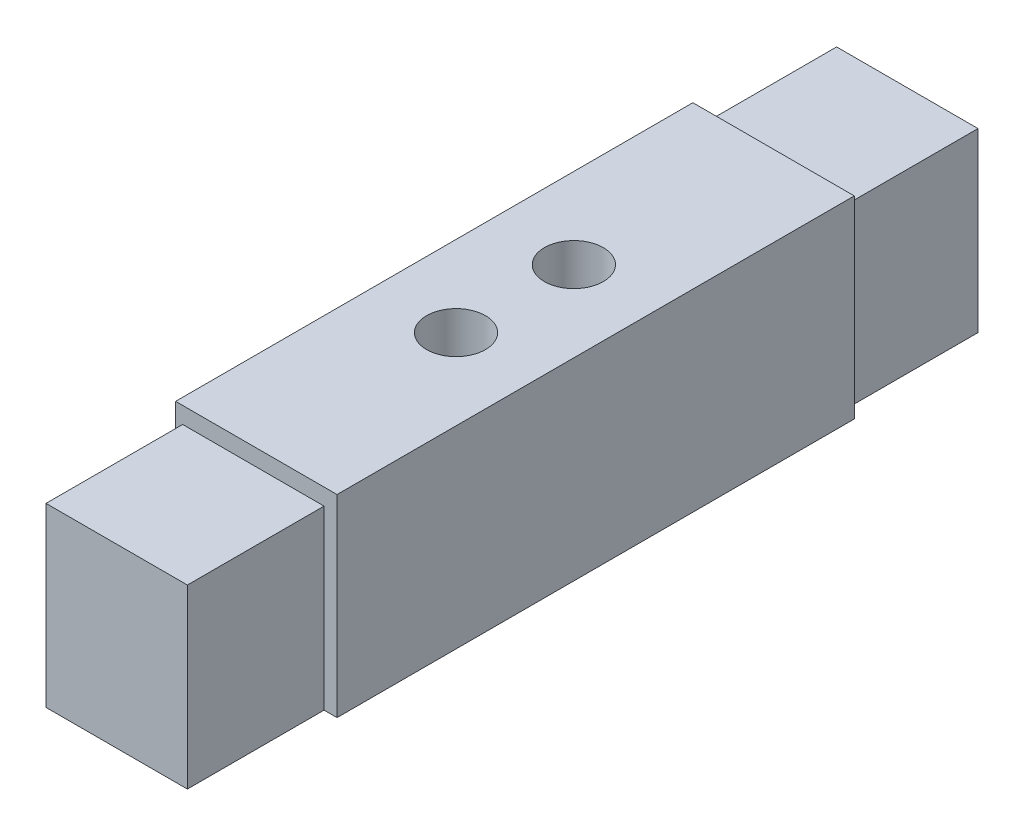
ISO-10303-21;
HEADER;
FILE_DESCRIPTION(('STEP AP214'),'2;1');
FILE_NAME('part.step','',(''),(''),'','','');
FILE_SCHEMA(('AUTOMOTIVE_DESIGN { 1 0 10303 214 1 1 1 1 }'));
ENDSEC;
DATA;
#1=APPLICATION_CONTEXT('core data for automotive mechanical design processes');
#2=APPLICATION_PROTOCOL_DEFINITION('international standard','automotive_design',2000,#1);
#3=PRODUCT_CONTEXT('',#1,'mechanical');
#4=PRODUCT('Part','Part','',(#3));
#5=PRODUCT_RELATED_PRODUCT_CATEGORY('part','',(#4));
#6=PRODUCT_DEFINITION_FORMATION('','',#4);
#7=PRODUCT_DEFINITION_CONTEXT('part definition',#1,'design');
#8=PRODUCT_DEFINITION('design','',#6,#7);
#9=PRODUCT_DEFINITION_SHAPE('','',#8);
#10=(LENGTH_UNIT() NAMED_UNIT(*) SI_UNIT(.MILLI.,.METRE.));
#11=(NAMED_UNIT(*) PLANE_ANGLE_UNIT() SI_UNIT($,.RADIAN.));
#12=(NAMED_UNIT(*) SI_UNIT($,.STERADIAN.) SOLID_ANGLE_UNIT());
#13=UNCERTAINTY_MEASURE_WITH_UNIT(LENGTH_MEASURE(1.E-05),#10,'distance_accuracy_value','');
#14=(GEOMETRIC_REPRESENTATION_CONTEXT(3) GLOBAL_UNCERTAINTY_ASSIGNED_CONTEXT((#13)) GLOBAL_UNIT_ASSIGNED_CONTEXT((#10,
#11,#12)) REPRESENTATION_CONTEXT('',''));
#15=CARTESIAN_POINT('',(0.,0.,0.));
#16=DIRECTION('',(0.,0.,1.));
#17=DIRECTION('',(1.,0.,0.));
#18=AXIS2_PLACEMENT_3D('',#15,#16,#17);
#19=CARTESIAN_POINT('',(0.,0.,0.));
#20=DIRECTION('',(0.,0.,-1.));
#21=DIRECTION('',(-1.,0.,0.));
#22=AXIS2_PLACEMENT_3D('',#19,#20,#21);
#23=PLANE('',#22);
#24=DIRECTION('',(1.,0.,0.));
#25=VECTOR('',#24,1.);
#26=CARTESIAN_POINT('',(0.,0.,0.));
#27=LINE('',#26,#25);
#28=CARTESIAN_POINT('',(32.004,0.,0.));
#29=VERTEX_POINT('',#28);
#30=CARTESIAN_POINT('',(34.798,0.,0.));
#31=VERTEX_POINT('',#30);
#32=EDGE_CURVE('E58',#29,#31,#27,.T.);
#33=ORIENTED_EDGE('',*,*,#32,.F.);
#34=DIRECTION('',(0.,1.,0.));
#35=VECTOR('',#34,1.);
#36=CARTESIAN_POINT('',(32.004,0.,0.));
#37=LINE('',#36,#35);
#38=CARTESIAN_POINT('',(32.004,38.1,0.));
#39=VERTEX_POINT('',#38);
#40=EDGE_CURVE('E53',#29,#39,#37,.T.);
#41=ORIENTED_EDGE('',*,*,#40,.T.);
#42=DIRECTION('',(1.,0.,0.));
#43=VECTOR('',#42,1.);
#44=CARTESIAN_POINT('',(1.52400000000001,38.1,0.));
#45=LINE('',#44,#43);
#46=CARTESIAN_POINT('',(1.52400000000001,38.1,0.));
#47=VERTEX_POINT('',#46);
#48=EDGE_CURVE('E151',#47,#39,#45,.T.);
#49=ORIENTED_EDGE('',*,*,#48,.F.);
#50=DIRECTION('',(0.,1.,0.));
#51=VECTOR('',#50,1.);
#52=CARTESIAN_POINT('',(1.52400000000001,0.,0.));
#53=LINE('',#52,#51);
#54=CARTESIAN_POINT('',(1.52400000000001,0.,0.));
#55=VERTEX_POINT('',#54);
#56=EDGE_CURVE('E160',#55,#47,#53,.T.);
#57=ORIENTED_EDGE('',*,*,#56,.F.);
#58=CARTESIAN_POINT('',(0.,0.,0.));
#59=VERTEX_POINT('',#58);
#60=EDGE_CURVE('E133',#59,#55,#27,.T.);
#61=ORIENTED_EDGE('',*,*,#60,.F.);
#62=DIRECTION('',(0.,1.,0.));
#63=VECTOR('',#62,1.);
#64=CARTESIAN_POINT('',(0.,0.,0.));
#65=LINE('',#64,#63);
#66=CARTESIAN_POINT('',(0.,41.656,0.));
#67=VERTEX_POINT('',#66);
#68=EDGE_CURVE('E198',#59,#67,#65,.T.);
#69=ORIENTED_EDGE('',*,*,#68,.T.);
#70=DIRECTION('',(1.,0.,0.));
#71=VECTOR('',#70,1.);
#72=CARTESIAN_POINT('',(0.,41.656,0.));
#73=LINE('',#72,#71);
#74=CARTESIAN_POINT('',(34.798,41.656,0.));
#75=VERTEX_POINT('',#74);
#76=EDGE_CURVE('E212',#67,#75,#73,.T.);
#77=ORIENTED_EDGE('',*,*,#76,.T.);
#78=DIRECTION('',(0.,1.,0.));
#79=VECTOR('',#78,1.);
#80=CARTESIAN_POINT('',(34.798,0.,0.));
#81=LINE('',#80,#79);
#82=EDGE_CURVE('E215',#31,#75,#81,.T.);
#83=ORIENTED_EDGE('',*,*,#82,.F.);
#84=EDGE_LOOP('',(#33,#41,#49,#57,#61,#69,#77,#83));
#85=FACE_BOUND('',#84,.T.);
#86=ADVANCED_FACE('F36',(#85),#23,.T.);
#87=CARTESIAN_POINT('',(0.,0.,111.506));
#88=DIRECTION('',(-1.,0.,0.));
#89=DIRECTION('',(0.,0.,1.));
#90=AXIS2_PLACEMENT_3D('',#87,#88,#89);
#91=PLANE('',#90);
#92=ORIENTED_EDGE('',*,*,#68,.F.);
#93=DIRECTION('',(0.,0.,-1.));
#94=VECTOR('',#93,1.);
#95=CARTESIAN_POINT('',(0.,0.,111.506));
#96=LINE('',#95,#94);
#97=CARTESIAN_POINT('',(0.,0.,111.506));
#98=VERTEX_POINT('',#97);
#99=EDGE_CURVE('E11',#98,#59,#96,.T.);
#100=ORIENTED_EDGE('',*,*,#99,.F.);
#101=DIRECTION('',(0.,1.,0.));
#102=VECTOR('',#101,1.);
#103=CARTESIAN_POINT('',(0.,0.,111.506));
#104=LINE('',#103,#102);
#105=CARTESIAN_POINT('',(0.,41.656,111.506));
#106=VERTEX_POINT('',#105);
#107=EDGE_CURVE('E199',#98,#106,#104,.T.);
#108=ORIENTED_EDGE('',*,*,#107,.T.);
#109=DIRECTION('',(0.,0.,-1.));
#110=VECTOR('',#109,1.);
#111=CARTESIAN_POINT('',(0.,41.656,111.506));
#112=LINE('',#111,#110);
#113=EDGE_CURVE('E40',#106,#67,#112,.T.);
#114=ORIENTED_EDGE('',*,*,#113,.T.);
#115=EDGE_LOOP('',(#92,#100,#108,#114));
#116=FACE_BOUND('',#115,.T.);
#117=ADVANCED_FACE('F38',(#116),#91,.T.);
#118=CARTESIAN_POINT('',(0.,0.,111.506));
#119=DIRECTION('',(0.,1.,0.));
#120=DIRECTION('',(0.,0.,1.));
#121=AXIS2_PLACEMENT_3D('',#118,#119,#120);
#122=PLANE('',#121);
#123=CARTESIAN_POINT('',(16.764,0.,55.753));
#124=DIRECTION('',(0.,-1.,0.));
#125=DIRECTION('',(0.,0.,-1.));
#126=AXIS2_PLACEMENT_3D('',#123,#124,#125);
#127=CIRCLE('',#126,6.35);
#128=CARTESIAN_POINT('',(16.764,0.,49.403));
#129=VERTEX_POINT('',#128);
#130=EDGE_CURVE('E154',#129,#129,#127,.T.);
#131=ORIENTED_EDGE('',*,*,#130,.F.);
#132=EDGE_LOOP('',(#131));
#133=FACE_BOUND('',#132,.T.);
#134=ORIENTED_EDGE('',*,*,#60,.T.);
#135=DIRECTION('',(0.,0.,1.));
#136=VECTOR('',#135,1.);
#137=CARTESIAN_POINT('',(1.52400000000001,0.,-29.464));
#138=LINE('',#137,#136);
#139=CARTESIAN_POINT('',(1.52400000000001,0.,-29.464));
#140=VERTEX_POINT('',#139);
#141=EDGE_CURVE('E126',#140,#55,#138,.T.);
#142=ORIENTED_EDGE('',*,*,#141,.F.);
#143=DIRECTION('',(1.,0.,0.));
#144=VECTOR('',#143,1.);
#145=CARTESIAN_POINT('',(1.52400000000001,0.,-29.464));
#146=LINE('',#145,#144);
#147=CARTESIAN_POINT('',(32.004,0.,-29.464));
#148=VERTEX_POINT('',#147);
#149=EDGE_CURVE('E130',#140,#148,#146,.T.);
#150=ORIENTED_EDGE('',*,*,#149,.T.);
#151=DIRECTION('',(0.,0.,1.));
#152=VECTOR('',#151,1.);
#153=CARTESIAN_POINT('',(32.004,0.,-29.464));
#154=LINE('',#153,#152);
#155=EDGE_CURVE('E159',#148,#29,#154,.T.);
#156=ORIENTED_EDGE('',*,*,#155,.T.);
#157=ORIENTED_EDGE('',*,*,#32,.T.);
#158=DIRECTION('',(0.,0.,-1.));
#159=VECTOR('',#158,1.);
#160=CARTESIAN_POINT('',(34.798,0.,111.506));
#161=LINE('',#160,#159);
#162=CARTESIAN_POINT('',(34.798,0.,111.506));
#163=VERTEX_POINT('',#162);
#164=EDGE_CURVE('E45',#163,#31,#161,.T.);
#165=ORIENTED_EDGE('',*,*,#164,.F.);
#166=DIRECTION('',(1.,0.,0.));
#167=VECTOR('',#166,1.);
#168=CARTESIAN_POINT('',(0.,0.,111.506));
#169=LINE('',#168,#167);
#170=CARTESIAN_POINT('',(32.004,0.,111.506));
#171=VERTEX_POINT('',#170);
#172=EDGE_CURVE('E207',#171,#163,#169,.T.);
#173=ORIENTED_EDGE('',*,*,#172,.F.);
#174=DIRECTION('',(0.,0.,-1.));
#175=VECTOR('',#174,1.);
#176=CARTESIAN_POINT('',(32.004,0.,140.97));
#177=LINE('',#176,#175);
#178=CARTESIAN_POINT('',(32.004,0.,140.97));
#179=VERTEX_POINT('',#178);
#180=EDGE_CURVE('E195',#179,#171,#177,.T.);
#181=ORIENTED_EDGE('',*,*,#180,.F.);
#182=DIRECTION('',(1.,0.,0.));
#183=VECTOR('',#182,1.);
#184=CARTESIAN_POINT('',(1.52400000000001,0.,140.97));
#185=LINE('',#184,#183);
#186=CARTESIAN_POINT('',(1.52400000000001,0.,140.97));
#187=VERTEX_POINT('',#186);
#188=EDGE_CURVE('E169',#187,#179,#185,.T.);
#189=ORIENTED_EDGE('',*,*,#188,.F.);
#190=DIRECTION('',(0.,0.,-1.));
#191=VECTOR('',#190,1.);
#192=CARTESIAN_POINT('',(1.52400000000001,0.,140.97));
#193=LINE('',#192,#191);
#194=CARTESIAN_POINT('',(1.52400000000001,0.,111.506));
#195=VERTEX_POINT('',#194);
#196=EDGE_CURVE('E181',#187,#195,#193,.T.);
#197=ORIENTED_EDGE('',*,*,#196,.T.);
#198=EDGE_CURVE('E208',#98,#195,#169,.T.);
#199=ORIENTED_EDGE('',*,*,#198,.F.);
#200=ORIENTED_EDGE('',*,*,#99,.T.);
#201=EDGE_LOOP('',(#134,#142,#150,#156,#157,#165,#173,#181,#189,#197,#199,#200));
#202=FACE_BOUND('',#201,.T.);
#203=ADVANCED_FACE('F128',(#133,#202),#122,.F.);
#204=CARTESIAN_POINT('',(34.798,0.,111.506));
#205=DIRECTION('',(-1.,0.,0.));
#206=DIRECTION('',(0.,0.,1.));
#207=AXIS2_PLACEMENT_3D('',#204,#205,#206);
#208=PLANE('',#207);
#209=ORIENTED_EDGE('',*,*,#82,.T.);
#210=DIRECTION('',(0.,0.,-1.));
#211=VECTOR('',#210,1.);
#212=CARTESIAN_POINT('',(34.798,41.656,111.506));
#213=LINE('',#212,#211);
#214=CARTESIAN_POINT('',(34.798,41.656,111.506));
#215=VERTEX_POINT('',#214);
#216=EDGE_CURVE('E220',#215,#75,#213,.T.);
#217=ORIENTED_EDGE('',*,*,#216,.F.);
#218=DIRECTION('',(0.,1.,0.));
#219=VECTOR('',#218,1.);
#220=CARTESIAN_POINT('',(34.798,0.,111.506));
#221=LINE('',#220,#219);
#222=EDGE_CURVE('E205',#163,#215,#221,.T.);
#223=ORIENTED_EDGE('',*,*,#222,.F.);
#224=ORIENTED_EDGE('',*,*,#164,.T.);
#225=EDGE_LOOP('',(#209,#217,#223,#224));
#226=FACE_BOUND('',#225,.T.);
#227=ADVANCED_FACE('F238',(#226),#208,.F.);
#228=CARTESIAN_POINT('',(0.,41.656,111.506));
#229=DIRECTION('',(0.,1.,0.));
#230=DIRECTION('',(0.,0.,1.));
#231=AXIS2_PLACEMENT_3D('',#228,#229,#230);
#232=PLANE('',#231);
#233=CARTESIAN_POINT('',(17.399,41.656,68.453));
#234=DIRECTION('',(0.,1.,0.));
#235=DIRECTION('',(0.,0.,1.));
#236=AXIS2_PLACEMENT_3D('',#233,#234,#235);
#237=CIRCLE('',#236,6.35);
#238=CARTESIAN_POINT('',(17.399,41.656,74.803));
#239=VERTEX_POINT('',#238);
#240=EDGE_CURVE('E284',#239,#239,#237,.T.);
#241=ORIENTED_EDGE('',*,*,#240,.F.);
#242=EDGE_LOOP('',(#241));
#243=FACE_BOUND('',#242,.T.);
#244=CARTESIAN_POINT('',(17.399,41.656,43.053));
#245=DIRECTION('',(0.,1.,0.));
#246=DIRECTION('',(0.,0.,1.));
#247=AXIS2_PLACEMENT_3D('',#244,#245,#246);
#248=CIRCLE('',#247,6.35);
#249=CARTESIAN_POINT('',(17.399,41.656,49.403));
#250=VERTEX_POINT('',#249);
#251=EDGE_CURVE('E287',#250,#250,#248,.T.);
#252=ORIENTED_EDGE('',*,*,#251,.F.);
#253=EDGE_LOOP('',(#252));
#254=FACE_BOUND('',#253,.T.);
#255=ORIENTED_EDGE('',*,*,#76,.F.);
#256=ORIENTED_EDGE('',*,*,#113,.F.);
#257=DIRECTION('',(1.,0.,0.));
#258=VECTOR('',#257,1.);
#259=CARTESIAN_POINT('',(0.,41.656,111.506));
#260=LINE('',#259,#258);
#261=EDGE_CURVE('E202',#106,#215,#260,.T.);
#262=ORIENTED_EDGE('',*,*,#261,.T.);
#263=ORIENTED_EDGE('',*,*,#216,.T.);
#264=EDGE_LOOP('',(#255,#256,#262,#263));
#265=FACE_BOUND('',#264,.T.);
#266=ADVANCED_FACE('F228',(#243,#254,#265),#232,.T.);
#267=CARTESIAN_POINT('',(0.,0.,111.506));
#268=DIRECTION('',(0.,0.,-1.));
#269=DIRECTION('',(-1.,0.,0.));
#270=AXIS2_PLACEMENT_3D('',#267,#268,#269);
#271=PLANE('',#270);
#272=ORIENTED_EDGE('',*,*,#198,.T.);
#273=DIRECTION('',(0.,1.,0.));
#274=VECTOR('',#273,1.);
#275=CARTESIAN_POINT('',(1.52400000000001,0.,111.506));
#276=LINE('',#275,#274);
#277=CARTESIAN_POINT('',(1.52400000000001,38.1,111.506));
#278=VERTEX_POINT('',#277);
#279=EDGE_CURVE('E173',#195,#278,#276,.T.);
#280=ORIENTED_EDGE('',*,*,#279,.T.);
#281=DIRECTION('',(1.,0.,0.));
#282=VECTOR('',#281,1.);
#283=CARTESIAN_POINT('',(1.52400000000001,38.1,111.506));
#284=LINE('',#283,#282);
#285=CARTESIAN_POINT('',(32.004,38.1,111.506));
#286=VERTEX_POINT('',#285);
#287=EDGE_CURVE('E184',#278,#286,#284,.T.);
#288=ORIENTED_EDGE('',*,*,#287,.T.);
#289=DIRECTION('',(0.,1.,0.));
#290=VECTOR('',#289,1.);
#291=CARTESIAN_POINT('',(32.004,0.,111.506));
#292=LINE('',#291,#290);
#293=EDGE_CURVE('E136',#171,#286,#292,.T.);
#294=ORIENTED_EDGE('',*,*,#293,.F.);
#295=ORIENTED_EDGE('',*,*,#172,.T.);
#296=ORIENTED_EDGE('',*,*,#222,.T.);
#297=ORIENTED_EDGE('',*,*,#261,.F.);
#298=ORIENTED_EDGE('',*,*,#107,.F.);
#299=EDGE_LOOP('',(#272,#280,#288,#294,#295,#296,#297,#298));
#300=FACE_BOUND('',#299,.T.);
#301=ADVANCED_FACE('F240',(#300),#271,.F.);
#302=CARTESIAN_POINT('',(32.004,0.,140.97));
#303=DIRECTION('',(-1.,0.,0.));
#304=DIRECTION('',(0.,0.,1.));
#305=AXIS2_PLACEMENT_3D('',#302,#303,#304);
#306=PLANE('',#305);
#307=ORIENTED_EDGE('',*,*,#293,.T.);
#308=DIRECTION('',(0.,0.,-1.));
#309=VECTOR('',#308,1.);
#310=CARTESIAN_POINT('',(32.004,38.1,140.97));
#311=LINE('',#310,#309);
#312=CARTESIAN_POINT('',(32.004,38.1,140.97));
#313=VERTEX_POINT('',#312);
#314=EDGE_CURVE('E192',#313,#286,#311,.T.);
#315=ORIENTED_EDGE('',*,*,#314,.F.);
#316=DIRECTION('',(0.,1.,0.));
#317=VECTOR('',#316,1.);
#318=CARTESIAN_POINT('',(32.004,0.,140.97));
#319=LINE('',#318,#317);
#320=EDGE_CURVE('E172',#179,#313,#319,.T.);
#321=ORIENTED_EDGE('',*,*,#320,.F.);
#322=ORIENTED_EDGE('',*,*,#180,.T.);
#323=EDGE_LOOP('',(#307,#315,#321,#322));
#324=FACE_BOUND('',#323,.T.);
#325=ADVANCED_FACE('F244',(#324),#306,.F.);
#326=CARTESIAN_POINT('',(1.52400000000001,38.1,140.97));
#327=DIRECTION('',(0.,1.,0.));
#328=DIRECTION('',(0.,0.,1.));
#329=AXIS2_PLACEMENT_3D('',#326,#327,#328);
#330=PLANE('',#329);
#331=ORIENTED_EDGE('',*,*,#287,.F.);
#332=DIRECTION('',(0.,0.,-1.));
#333=VECTOR('',#332,1.);
#334=CARTESIAN_POINT('',(1.52400000000001,38.1,140.97));
#335=LINE('',#334,#333);
#336=CARTESIAN_POINT('',(1.52400000000001,38.1,140.97));
#337=VERTEX_POINT('',#336);
#338=EDGE_CURVE('E189',#337,#278,#335,.T.);
#339=ORIENTED_EDGE('',*,*,#338,.F.);
#340=DIRECTION('',(1.,0.,0.));
#341=VECTOR('',#340,1.);
#342=CARTESIAN_POINT('',(1.52400000000001,38.1,140.97));
#343=LINE('',#342,#341);
#344=EDGE_CURVE('E175',#337,#313,#343,.T.);
#345=ORIENTED_EDGE('',*,*,#344,.T.);
#346=ORIENTED_EDGE('',*,*,#314,.T.);
#347=EDGE_LOOP('',(#331,#339,#345,#346));
#348=FACE_BOUND('',#347,.T.);
#349=ADVANCED_FACE('F256',(#348),#330,.T.);
#350=CARTESIAN_POINT('',(1.52400000000001,0.,140.97));
#351=DIRECTION('',(-1.,0.,0.));
#352=DIRECTION('',(0.,0.,1.));
#353=AXIS2_PLACEMENT_3D('',#350,#351,#352);
#354=PLANE('',#353);
#355=ORIENTED_EDGE('',*,*,#279,.F.);
#356=ORIENTED_EDGE('',*,*,#196,.F.);
#357=DIRECTION('',(0.,1.,0.));
#358=VECTOR('',#357,1.);
#359=CARTESIAN_POINT('',(1.52400000000001,0.,140.97));
#360=LINE('',#359,#358);
#361=EDGE_CURVE('E178',#187,#337,#360,.T.);
#362=ORIENTED_EDGE('',*,*,#361,.T.);
#363=ORIENTED_EDGE('',*,*,#338,.T.);
#364=EDGE_LOOP('',(#355,#356,#362,#363));
#365=FACE_BOUND('',#364,.T.);
#366=ADVANCED_FACE('F253',(#365),#354,.T.);
#367=CARTESIAN_POINT('',(0.,0.,140.97));
#368=DIRECTION('',(0.,0.,1.));
#369=DIRECTION('',(1.,0.,0.));
#370=AXIS2_PLACEMENT_3D('',#367,#368,#369);
#371=PLANE('',#370);
#372=ORIENTED_EDGE('',*,*,#188,.T.);
#373=ORIENTED_EDGE('',*,*,#320,.T.);
#374=ORIENTED_EDGE('',*,*,#344,.F.);
#375=ORIENTED_EDGE('',*,*,#361,.F.);
#376=EDGE_LOOP('',(#372,#373,#374,#375));
#377=FACE_BOUND('',#376,.T.);
#378=ADVANCED_FACE('F249',(#377),#371,.T.);
#379=CARTESIAN_POINT('',(1.52400000000001,0.,-29.464));
#380=DIRECTION('',(1.,0.,0.));
#381=DIRECTION('',(0.,0.,-1.));
#382=AXIS2_PLACEMENT_3D('',#379,#380,#381);
#383=PLANE('',#382);
#384=ORIENTED_EDGE('',*,*,#56,.T.);
#385=DIRECTION('',(0.,0.,1.));
#386=VECTOR('',#385,1.);
#387=CARTESIAN_POINT('',(1.52400000000001,38.1,-29.464));
#388=LINE('',#387,#386);
#389=CARTESIAN_POINT('',(1.52400000000001,38.1,-29.464));
#390=VERTEX_POINT('',#389);
#391=EDGE_CURVE('E137',#390,#47,#388,.T.);
#392=ORIENTED_EDGE('',*,*,#391,.F.);
#393=DIRECTION('',(0.,1.,0.));
#394=VECTOR('',#393,1.);
#395=CARTESIAN_POINT('',(1.52400000000001,0.,-29.464));
#396=LINE('',#395,#394);
#397=EDGE_CURVE('E140',#140,#390,#396,.T.);
#398=ORIENTED_EDGE('',*,*,#397,.F.);
#399=ORIENTED_EDGE('',*,*,#141,.T.);
#400=EDGE_LOOP('',(#384,#392,#398,#399));
#401=FACE_BOUND('',#400,.T.);
#402=ADVANCED_FACE('F141',(#401),#383,.F.);
#403=CARTESIAN_POINT('',(1.52400000000001,38.1,-29.464));
#404=DIRECTION('',(0.,-1.,0.));
#405=DIRECTION('',(0.,0.,-1.));
#406=AXIS2_PLACEMENT_3D('',#403,#404,#405);
#407=PLANE('',#406);
#408=ORIENTED_EDGE('',*,*,#48,.T.);
#409=DIRECTION('',(0.,0.,1.));
#410=VECTOR('',#409,1.);
#411=CARTESIAN_POINT('',(32.004,38.1,-29.464));
#412=LINE('',#411,#410);
#413=CARTESIAN_POINT('',(32.004,38.1,-29.464));
#414=VERTEX_POINT('',#413);
#415=EDGE_CURVE('E166',#414,#39,#412,.T.);
#416=ORIENTED_EDGE('',*,*,#415,.F.);
#417=DIRECTION('',(1.,0.,0.));
#418=VECTOR('',#417,1.);
#419=CARTESIAN_POINT('',(1.52400000000001,38.1,-29.464));
#420=LINE('',#419,#418);
#421=EDGE_CURVE('E145',#390,#414,#420,.T.);
#422=ORIENTED_EDGE('',*,*,#421,.F.);
#423=ORIENTED_EDGE('',*,*,#391,.T.);
#424=EDGE_LOOP('',(#408,#416,#422,#423));
#425=FACE_BOUND('',#424,.T.);
#426=ADVANCED_FACE('F230',(#425),#407,.F.);
#427=CARTESIAN_POINT('',(32.004,0.,-29.464));
#428=DIRECTION('',(1.,0.,0.));
#429=DIRECTION('',(0.,0.,-1.));
#430=AXIS2_PLACEMENT_3D('',#427,#428,#429);
#431=PLANE('',#430);
#432=ORIENTED_EDGE('',*,*,#40,.F.);
#433=ORIENTED_EDGE('',*,*,#155,.F.);
#434=DIRECTION('',(0.,1.,0.));
#435=VECTOR('',#434,1.);
#436=CARTESIAN_POINT('',(32.004,0.,-29.464));
#437=LINE('',#436,#435);
#438=EDGE_CURVE('E149',#148,#414,#437,.T.);
#439=ORIENTED_EDGE('',*,*,#438,.T.);
#440=ORIENTED_EDGE('',*,*,#415,.T.);
#441=EDGE_LOOP('',(#432,#433,#439,#440));
#442=FACE_BOUND('',#441,.T.);
#443=ADVANCED_FACE('F233',(#442),#431,.T.);
#444=CARTESIAN_POINT('',(0.,0.,-29.464));
#445=DIRECTION('',(0.,0.,-1.));
#446=DIRECTION('',(1.,0.,0.));
#447=AXIS2_PLACEMENT_3D('',#444,#445,#446);
#448=PLANE('',#447);
#449=ORIENTED_EDGE('',*,*,#149,.F.);
#450=ORIENTED_EDGE('',*,*,#397,.T.);
#451=ORIENTED_EDGE('',*,*,#421,.T.);
#452=ORIENTED_EDGE('',*,*,#438,.F.);
#453=EDGE_LOOP('',(#449,#450,#451,#452));
#454=FACE_BOUND('',#453,.T.);
#455=ADVANCED_FACE('F147',(#454),#448,.T.);
#456=CARTESIAN_POINT('',(16.764,12.7,55.753));
#457=DIRECTION('',(0.,-1.,0.));
#458=DIRECTION('',(0.,0.,-1.));
#459=AXIS2_PLACEMENT_3D('',#456,#457,#458);
#460=CYLINDRICAL_SURFACE('',#459,6.35);
#461=CARTESIAN_POINT('',(16.764,12.7,55.753));
#462=DIRECTION('',(0.,-1.,0.));
#463=DIRECTION('',(0.,0.,-1.));
#464=AXIS2_PLACEMENT_3D('',#461,#462,#463);
#465=CIRCLE('',#464,6.35);
#466=CARTESIAN_POINT('',(16.764,12.7,49.403));
#467=VERTEX_POINT('',#466);
#468=EDGE_CURVE('E162',#467,#467,#465,.T.);
#469=ORIENTED_EDGE('',*,*,#468,.F.);
#470=EDGE_LOOP('',(#469));
#471=FACE_BOUND('',#470,.T.);
#472=ORIENTED_EDGE('',*,*,#130,.T.);
#473=EDGE_LOOP('',(#472));
#474=FACE_BOUND('',#473,.T.);
#475=ADVANCED_FACE('F327',(#471,#474),#460,.F.);
#476=CARTESIAN_POINT('',(16.764,12.7,55.753));
#477=DIRECTION('',(0.,-1.,0.));
#478=DIRECTION('',(0.,0.,-1.));
#479=AXIS2_PLACEMENT_3D('',#476,#477,#478);
#480=PLANE('',#479);
#481=ORIENTED_EDGE('',*,*,#468,.T.);
#482=EDGE_LOOP('',(#481));
#483=FACE_BOUND('',#482,.T.);
#484=ADVANCED_FACE('F322',(#483),#480,.T.);
#485=CARTESIAN_POINT('',(17.399,28.956,43.053));
#486=DIRECTION('',(0.,1.,0.));
#487=DIRECTION('',(0.,0.,1.));
#488=AXIS2_PLACEMENT_3D('',#485,#486,#487);
#489=CYLINDRICAL_SURFACE('',#488,6.35);
#490=CARTESIAN_POINT('',(17.399,28.956,43.053));
#491=DIRECTION('',(0.,1.,0.));
#492=DIRECTION('',(0.,0.,1.));
#493=AXIS2_PLACEMENT_3D('',#490,#491,#492);
#494=CIRCLE('',#493,6.35);
#495=CARTESIAN_POINT('',(17.399,28.956,49.403));
#496=VERTEX_POINT('',#495);
#497=EDGE_CURVE('E289',#496,#496,#494,.T.);
#498=ORIENTED_EDGE('',*,*,#497,.F.);
#499=EDGE_LOOP('',(#498));
#500=FACE_BOUND('',#499,.T.);
#501=ORIENTED_EDGE('',*,*,#251,.T.);
#502=EDGE_LOOP('',(#501));
#503=FACE_BOUND('',#502,.T.);
#504=ADVANCED_FACE('F317',(#500,#503),#489,.F.);
#505=CARTESIAN_POINT('',(17.399,28.956,43.053));
#506=DIRECTION('',(0.,1.,0.));
#507=DIRECTION('',(0.,0.,1.));
#508=AXIS2_PLACEMENT_3D('',#505,#506,#507);
#509=PLANE('',#508);
#510=ORIENTED_EDGE('',*,*,#497,.T.);
#511=EDGE_LOOP('',(#510));
#512=FACE_BOUND('',#511,.T.);
#513=ADVANCED_FACE('F310',(#512),#509,.T.);
#514=CARTESIAN_POINT('',(17.399,28.956,68.453));
#515=DIRECTION('',(0.,1.,0.));
#516=DIRECTION('',(0.,0.,1.));
#517=AXIS2_PLACEMENT_3D('',#514,#515,#516);
#518=CYLINDRICAL_SURFACE('',#517,6.35);
#519=CARTESIAN_POINT('',(17.399,28.956,68.453));
#520=DIRECTION('',(0.,1.,0.));
#521=DIRECTION('',(0.,0.,1.));
#522=AXIS2_PLACEMENT_3D('',#519,#520,#521);
#523=CIRCLE('',#522,6.35);
#524=CARTESIAN_POINT('',(17.399,28.956,74.803));
#525=VERTEX_POINT('',#524);
#526=EDGE_CURVE('E291',#525,#525,#523,.T.);
#527=ORIENTED_EDGE('',*,*,#526,.F.);
#528=EDGE_LOOP('',(#527));
#529=FACE_BOUND('',#528,.T.);
#530=ORIENTED_EDGE('',*,*,#240,.T.);
#531=EDGE_LOOP('',(#530));
#532=FACE_BOUND('',#531,.T.);
#533=ADVANCED_FACE('F307',(#529,#532),#518,.F.);
#534=CARTESIAN_POINT('',(17.399,28.956,68.453));
#535=DIRECTION('',(0.,1.,0.));
#536=DIRECTION('',(0.,0.,1.));
#537=AXIS2_PLACEMENT_3D('',#534,#535,#536);
#538=PLANE('',#537);
#539=ORIENTED_EDGE('',*,*,#526,.T.);
#540=EDGE_LOOP('',(#539));
#541=FACE_BOUND('',#540,.T.);
#542=ADVANCED_FACE('F305',(#541),#538,.T.);
#543=CLOSED_SHELL('',(#86,#117,#203,#227,#266,#301,#325,#349,#366,#378,#402,#426,#443,#455,#475,
#484,#504,#513,#533,#542));
#544=MANIFOLD_SOLID_BREP('B2',#543);
#545=ADVANCED_BREP_SHAPE_REPRESENTATION('',(#18,#544),#14);
#546=SHAPE_DEFINITION_REPRESENTATION(#9,#545);
ENDSEC;
END-ISO-10303-21;
